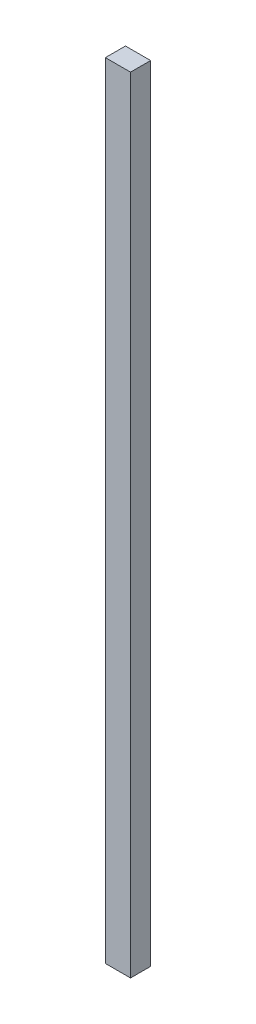
ISO-10303-21;
HEADER;
FILE_DESCRIPTION(('STEP AP214'),'2;1');
FILE_NAME('part.step','',(''),(''),'','','');
FILE_SCHEMA(('AUTOMOTIVE_DESIGN { 1 0 10303 214 1 1 1 1 }'));
ENDSEC;
DATA;
#1=APPLICATION_CONTEXT('core data for automotive mechanical design processes');
#2=APPLICATION_PROTOCOL_DEFINITION('international standard','automotive_design',2000,#1);
#3=PRODUCT_CONTEXT('',#1,'mechanical');
#4=PRODUCT('Part','Part','',(#3));
#5=PRODUCT_RELATED_PRODUCT_CATEGORY('part','',(#4));
#6=PRODUCT_DEFINITION_FORMATION('','',#4);
#7=PRODUCT_DEFINITION_CONTEXT('part definition',#1,'design');
#8=PRODUCT_DEFINITION('design','',#6,#7);
#9=PRODUCT_DEFINITION_SHAPE('','',#8);
#10=(LENGTH_UNIT() NAMED_UNIT(*) SI_UNIT(.MILLI.,.METRE.));
#11=(NAMED_UNIT(*) PLANE_ANGLE_UNIT() SI_UNIT($,.RADIAN.));
#12=(NAMED_UNIT(*) SI_UNIT($,.STERADIAN.) SOLID_ANGLE_UNIT());
#13=UNCERTAINTY_MEASURE_WITH_UNIT(LENGTH_MEASURE(1.E-05),#10,'distance_accuracy_value','');
#14=(GEOMETRIC_REPRESENTATION_CONTEXT(3) GLOBAL_UNCERTAINTY_ASSIGNED_CONTEXT((#13)) GLOBAL_UNIT_ASSIGNED_CONTEXT((#10,
#11,#12)) REPRESENTATION_CONTEXT('',''));
#15=CARTESIAN_POINT('',(0.,0.,0.));
#16=DIRECTION('',(0.,0.,1.));
#17=DIRECTION('',(1.,0.,0.));
#18=AXIS2_PLACEMENT_3D('',#15,#16,#17);
#19=CARTESIAN_POINT('',(0.,780.,0.));
#20=DIRECTION('',(1.,0.,0.));
#21=DIRECTION('',(0.,0.,-1.));
#22=AXIS2_PLACEMENT_3D('',#19,#20,#21);
#23=PLANE('',#22);
#24=DIRECTION('',(0.,0.,1.));
#25=VECTOR('',#24,1.);
#26=CARTESIAN_POINT('',(0.,0.,0.));
#27=LINE('',#26,#25);
#28=CARTESIAN_POINT('',(0.,0.,-20.));
#29=VERTEX_POINT('',#28);
#30=CARTESIAN_POINT('',(0.,0.,0.));
#31=VERTEX_POINT('',#30);
#32=EDGE_CURVE('E97',#29,#31,#27,.T.);
#33=ORIENTED_EDGE('',*,*,#32,.T.);
#34=DIRECTION('',(0.,-1.,0.));
#35=VECTOR('',#34,1.);
#36=CARTESIAN_POINT('',(0.,780.,0.));
#37=LINE('',#36,#35);
#38=CARTESIAN_POINT('',(0.,780.,0.));
#39=VERTEX_POINT('',#38);
#40=EDGE_CURVE('E11',#39,#31,#37,.T.);
#41=ORIENTED_EDGE('',*,*,#40,.F.);
#42=DIRECTION('',(0.,0.,1.));
#43=VECTOR('',#42,1.);
#44=CARTESIAN_POINT('',(0.,780.,0.));
#45=LINE('',#44,#43);
#46=CARTESIAN_POINT('',(0.,780.,-20.));
#47=VERTEX_POINT('',#46);
#48=EDGE_CURVE('E85',#47,#39,#45,.T.);
#49=ORIENTED_EDGE('',*,*,#48,.F.);
#50=DIRECTION('',(0.,-1.,0.));
#51=VECTOR('',#50,1.);
#52=CARTESIAN_POINT('',(0.,780.,-20.));
#53=LINE('',#52,#51);
#54=EDGE_CURVE('E93',#47,#29,#53,.T.);
#55=ORIENTED_EDGE('',*,*,#54,.T.);
#56=EDGE_LOOP('',(#33,#41,#49,#55));
#57=FACE_BOUND('',#56,.T.);
#58=ADVANCED_FACE('F34',(#57),#23,.F.);
#59=CARTESIAN_POINT('',(0.,780.,0.));
#60=DIRECTION('',(0.,0.,-1.));
#61=DIRECTION('',(-1.,0.,0.));
#62=AXIS2_PLACEMENT_3D('',#59,#60,#61);
#63=PLANE('',#62);
#64=DIRECTION('',(1.,0.,0.));
#65=VECTOR('',#64,1.);
#66=CARTESIAN_POINT('',(0.,0.,0.));
#67=LINE('',#66,#65);
#68=CARTESIAN_POINT('',(25.,0.,0.));
#69=VERTEX_POINT('',#68);
#70=EDGE_CURVE('E89',#31,#69,#67,.T.);
#71=ORIENTED_EDGE('',*,*,#70,.T.);
#72=DIRECTION('',(0.,-1.,0.));
#73=VECTOR('',#72,1.);
#74=CARTESIAN_POINT('',(25.,780.,0.));
#75=LINE('',#74,#73);
#76=CARTESIAN_POINT('',(25.,780.,0.));
#77=VERTEX_POINT('',#76);
#78=EDGE_CURVE('E42',#77,#69,#75,.T.);
#79=ORIENTED_EDGE('',*,*,#78,.F.);
#80=DIRECTION('',(1.,0.,0.));
#81=VECTOR('',#80,1.);
#82=CARTESIAN_POINT('',(0.,780.,0.));
#83=LINE('',#82,#81);
#84=EDGE_CURVE('E80',#39,#77,#83,.T.);
#85=ORIENTED_EDGE('',*,*,#84,.F.);
#86=ORIENTED_EDGE('',*,*,#40,.T.);
#87=EDGE_LOOP('',(#71,#79,#85,#86));
#88=FACE_BOUND('',#87,.T.);
#89=ADVANCED_FACE('F88',(#88),#63,.F.);
#90=CARTESIAN_POINT('',(25.,780.,0.));
#91=DIRECTION('',(-1.,0.,0.));
#92=DIRECTION('',(0.,0.,1.));
#93=AXIS2_PLACEMENT_3D('',#90,#91,#92);
#94=PLANE('',#93);
#95=DIRECTION('',(0.,0.,-1.));
#96=VECTOR('',#95,1.);
#97=CARTESIAN_POINT('',(25.,0.,0.));
#98=LINE('',#97,#96);
#99=CARTESIAN_POINT('',(25.,0.,-20.));
#100=VERTEX_POINT('',#99);
#101=EDGE_CURVE('E67',#69,#100,#98,.T.);
#102=ORIENTED_EDGE('',*,*,#101,.T.);
#103=DIRECTION('',(0.,-1.,0.));
#104=VECTOR('',#103,1.);
#105=CARTESIAN_POINT('',(25.,780.,-20.));
#106=LINE('',#105,#104);
#107=CARTESIAN_POINT('',(25.,780.,-20.));
#108=VERTEX_POINT('',#107);
#109=EDGE_CURVE('E90',#108,#100,#106,.T.);
#110=ORIENTED_EDGE('',*,*,#109,.F.);
#111=DIRECTION('',(0.,0.,-1.));
#112=VECTOR('',#111,1.);
#113=CARTESIAN_POINT('',(25.,780.,0.));
#114=LINE('',#113,#112);
#115=EDGE_CURVE('E83',#77,#108,#114,.T.);
#116=ORIENTED_EDGE('',*,*,#115,.F.);
#117=ORIENTED_EDGE('',*,*,#78,.T.);
#118=EDGE_LOOP('',(#102,#110,#116,#117));
#119=FACE_BOUND('',#118,.T.);
#120=ADVANCED_FACE('F91',(#119),#94,.F.);
#121=CARTESIAN_POINT('',(0.,780.,-20.));
#122=DIRECTION('',(0.,0.,1.));
#123=DIRECTION('',(1.,0.,0.));
#124=AXIS2_PLACEMENT_3D('',#121,#122,#123);
#125=PLANE('',#124);
#126=DIRECTION('',(-1.,0.,0.));
#127=VECTOR('',#126,1.);
#128=CARTESIAN_POINT('',(0.,0.,-20.));
#129=LINE('',#128,#127);
#130=EDGE_CURVE('E73',#100,#29,#129,.T.);
#131=ORIENTED_EDGE('',*,*,#130,.T.);
#132=ORIENTED_EDGE('',*,*,#54,.F.);
#133=DIRECTION('',(-1.,0.,0.));
#134=VECTOR('',#133,1.);
#135=CARTESIAN_POINT('',(0.,780.,-20.));
#136=LINE('',#135,#134);
#137=EDGE_CURVE('E50',#108,#47,#136,.T.);
#138=ORIENTED_EDGE('',*,*,#137,.F.);
#139=ORIENTED_EDGE('',*,*,#109,.T.);
#140=EDGE_LOOP('',(#131,#132,#138,#139));
#141=FACE_BOUND('',#140,.T.);
#142=ADVANCED_FACE('F104',(#141),#125,.F.);
#143=CARTESIAN_POINT('',(0.,780.,0.));
#144=DIRECTION('',(0.,-1.,0.));
#145=DIRECTION('',(0.,0.,-1.));
#146=AXIS2_PLACEMENT_3D('',#143,#144,#145);
#147=PLANE('',#146);
#148=ORIENTED_EDGE('',*,*,#48,.T.);
#149=ORIENTED_EDGE('',*,*,#84,.T.);
#150=ORIENTED_EDGE('',*,*,#115,.T.);
#151=ORIENTED_EDGE('',*,*,#137,.T.);
#152=EDGE_LOOP('',(#148,#149,#150,#151));
#153=FACE_BOUND('',#152,.T.);
#154=ADVANCED_FACE('F81',(#153),#147,.F.);
#155=CARTESIAN_POINT('',(0.,0.,0.));
#156=DIRECTION('',(0.,-1.,0.));
#157=DIRECTION('',(0.,0.,-1.));
#158=AXIS2_PLACEMENT_3D('',#155,#156,#157);
#159=PLANE('',#158);
#160=ORIENTED_EDGE('',*,*,#32,.F.);
#161=ORIENTED_EDGE('',*,*,#130,.F.);
#162=ORIENTED_EDGE('',*,*,#101,.F.);
#163=ORIENTED_EDGE('',*,*,#70,.F.);
#164=EDGE_LOOP('',(#160,#161,#162,#163));
#165=FACE_BOUND('',#164,.T.);
#166=ADVANCED_FACE('F107',(#165),#159,.T.);
#167=CLOSED_SHELL('',(#58,#89,#120,#142,#154,#166));
#168=MANIFOLD_SOLID_BREP('B2',#167);
#169=ADVANCED_BREP_SHAPE_REPRESENTATION('',(#18,#168),#14);
#170=SHAPE_DEFINITION_REPRESENTATION(#9,#169);
ENDSEC;
END-ISO-10303-21;
